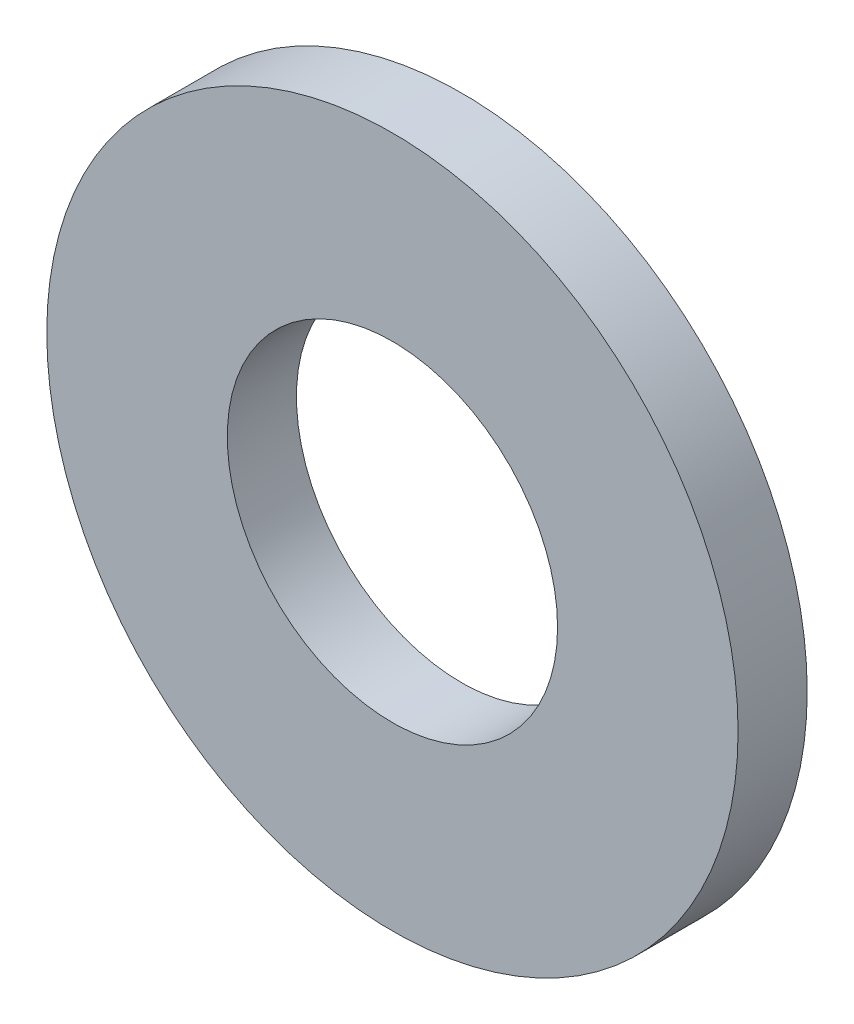
ISO-10303-21;
HEADER;
FILE_DESCRIPTION(('STEP AP214'),'2;1');
FILE_NAME('part.step','',(''),(''),'','','');
FILE_SCHEMA(('AUTOMOTIVE_DESIGN { 1 0 10303 214 1 1 1 1 }'));
ENDSEC;
DATA;
#1=APPLICATION_CONTEXT('core data for automotive mechanical design processes');
#2=APPLICATION_PROTOCOL_DEFINITION('international standard','automotive_design',2000,#1);
#3=PRODUCT_CONTEXT('',#1,'mechanical');
#4=PRODUCT('Part','Part','',(#3));
#5=PRODUCT_RELATED_PRODUCT_CATEGORY('part','',(#4));
#6=PRODUCT_DEFINITION_FORMATION('','',#4);
#7=PRODUCT_DEFINITION_CONTEXT('part definition',#1,'design');
#8=PRODUCT_DEFINITION('design','',#6,#7);
#9=PRODUCT_DEFINITION_SHAPE('','',#8);
#10=(LENGTH_UNIT() NAMED_UNIT(*) SI_UNIT(.MILLI.,.METRE.));
#11=(NAMED_UNIT(*) PLANE_ANGLE_UNIT() SI_UNIT($,.RADIAN.));
#12=(NAMED_UNIT(*) SI_UNIT($,.STERADIAN.) SOLID_ANGLE_UNIT());
#13=UNCERTAINTY_MEASURE_WITH_UNIT(LENGTH_MEASURE(1.E-05),#10,'distance_accuracy_value','');
#14=(GEOMETRIC_REPRESENTATION_CONTEXT(3) GLOBAL_UNCERTAINTY_ASSIGNED_CONTEXT((#13)) GLOBAL_UNIT_ASSIGNED_CONTEXT((#10,
#11,#12)) REPRESENTATION_CONTEXT('',''));
#15=CARTESIAN_POINT('',(0.,0.,0.));
#16=DIRECTION('',(0.,0.,1.));
#17=DIRECTION('',(1.,0.,0.));
#18=AXIS2_PLACEMENT_3D('',#15,#16,#17);
#19=CARTESIAN_POINT('',(0.,0.,0.9));
#20=DIRECTION('',(0.,0.,1.));
#21=DIRECTION('',(1.,0.,0.));
#22=AXIS2_PLACEMENT_3D('',#19,#20,#21);
#23=PLANE('',#22);
#24=CARTESIAN_POINT('',(0.,0.,0.9));
#25=DIRECTION('',(0.,0.,1.));
#26=DIRECTION('',(1.,0.,0.));
#27=AXIS2_PLACEMENT_3D('',#24,#25,#26);
#28=CIRCLE('',#27,4.5);
#29=CARTESIAN_POINT('',(4.5,0.,0.9));
#30=VERTEX_POINT('',#29);
#31=EDGE_CURVE('E10',#30,#30,#28,.T.);
#32=ORIENTED_EDGE('',*,*,#31,.T.);
#33=EDGE_LOOP('',(#32));
#34=FACE_BOUND('',#33,.T.);
#35=CARTESIAN_POINT('',(0.,0.,0.9));
#36=DIRECTION('',(0.,0.,1.));
#37=DIRECTION('',(1.,0.,0.));
#38=AXIS2_PLACEMENT_3D('',#35,#36,#37);
#39=CIRCLE('',#38,2.15);
#40=CARTESIAN_POINT('',(2.15,0.,0.9));
#41=VERTEX_POINT('',#40);
#42=EDGE_CURVE('E54',#41,#41,#39,.T.);
#43=ORIENTED_EDGE('',*,*,#42,.F.);
#44=EDGE_LOOP('',(#43));
#45=FACE_BOUND('',#44,.T.);
#46=ADVANCED_FACE('F41',(#34,#45),#23,.T.);
#47=CARTESIAN_POINT('',(0.,0.,0.));
#48=DIRECTION('',(0.,0.,1.));
#49=DIRECTION('',(1.,0.,0.));
#50=AXIS2_PLACEMENT_3D('',#47,#48,#49);
#51=PLANE('',#50);
#52=CARTESIAN_POINT('',(0.,0.,0.));
#53=DIRECTION('',(0.,0.,1.));
#54=DIRECTION('',(1.,0.,0.));
#55=AXIS2_PLACEMENT_3D('',#52,#53,#54);
#56=CIRCLE('',#55,4.5);
#57=CARTESIAN_POINT('',(4.5,0.,0.));
#58=VERTEX_POINT('',#57);
#59=EDGE_CURVE('E45',#58,#58,#56,.T.);
#60=ORIENTED_EDGE('',*,*,#59,.F.);
#61=EDGE_LOOP('',(#60));
#62=FACE_BOUND('',#61,.T.);
#63=CARTESIAN_POINT('',(0.,0.,0.));
#64=DIRECTION('',(0.,0.,1.));
#65=DIRECTION('',(1.,0.,0.));
#66=AXIS2_PLACEMENT_3D('',#63,#64,#65);
#67=CIRCLE('',#66,2.15);
#68=CARTESIAN_POINT('',(2.15,0.,0.));
#69=VERTEX_POINT('',#68);
#70=EDGE_CURVE('E56',#69,#69,#67,.T.);
#71=ORIENTED_EDGE('',*,*,#70,.T.);
#72=EDGE_LOOP('',(#71));
#73=FACE_BOUND('',#72,.T.);
#74=ADVANCED_FACE('F68',(#62,#73),#51,.F.);
#75=CARTESIAN_POINT('',(0.,0.,0.9));
#76=DIRECTION('',(0.,0.,-1.));
#77=DIRECTION('',(-1.,0.,0.));
#78=AXIS2_PLACEMENT_3D('',#75,#76,#77);
#79=CYLINDRICAL_SURFACE('',#78,4.5);
#80=ORIENTED_EDGE('',*,*,#31,.F.);
#81=EDGE_LOOP('',(#80));
#82=FACE_BOUND('',#81,.T.);
#83=ORIENTED_EDGE('',*,*,#59,.T.);
#84=EDGE_LOOP('',(#83));
#85=FACE_BOUND('',#84,.T.);
#86=ADVANCED_FACE('F43',(#82,#85),#79,.T.);
#87=CARTESIAN_POINT('',(0.,0.,0.9));
#88=DIRECTION('',(0.,0.,-1.));
#89=DIRECTION('',(-1.,0.,0.));
#90=AXIS2_PLACEMENT_3D('',#87,#88,#89);
#91=CYLINDRICAL_SURFACE('',#90,2.15);
#92=ORIENTED_EDGE('',*,*,#42,.T.);
#93=EDGE_LOOP('',(#92));
#94=FACE_BOUND('',#93,.T.);
#95=ORIENTED_EDGE('',*,*,#70,.F.);
#96=EDGE_LOOP('',(#95));
#97=FACE_BOUND('',#96,.T.);
#98=ADVANCED_FACE('F64',(#94,#97),#91,.F.);
#99=CLOSED_SHELL('',(#46,#74,#86,#98));
#100=MANIFOLD_SOLID_BREP('B2',#99);
#101=ADVANCED_BREP_SHAPE_REPRESENTATION('',(#18,#100),#14);
#102=SHAPE_DEFINITION_REPRESENTATION(#9,#101);
ENDSEC;
END-ISO-10303-21;
